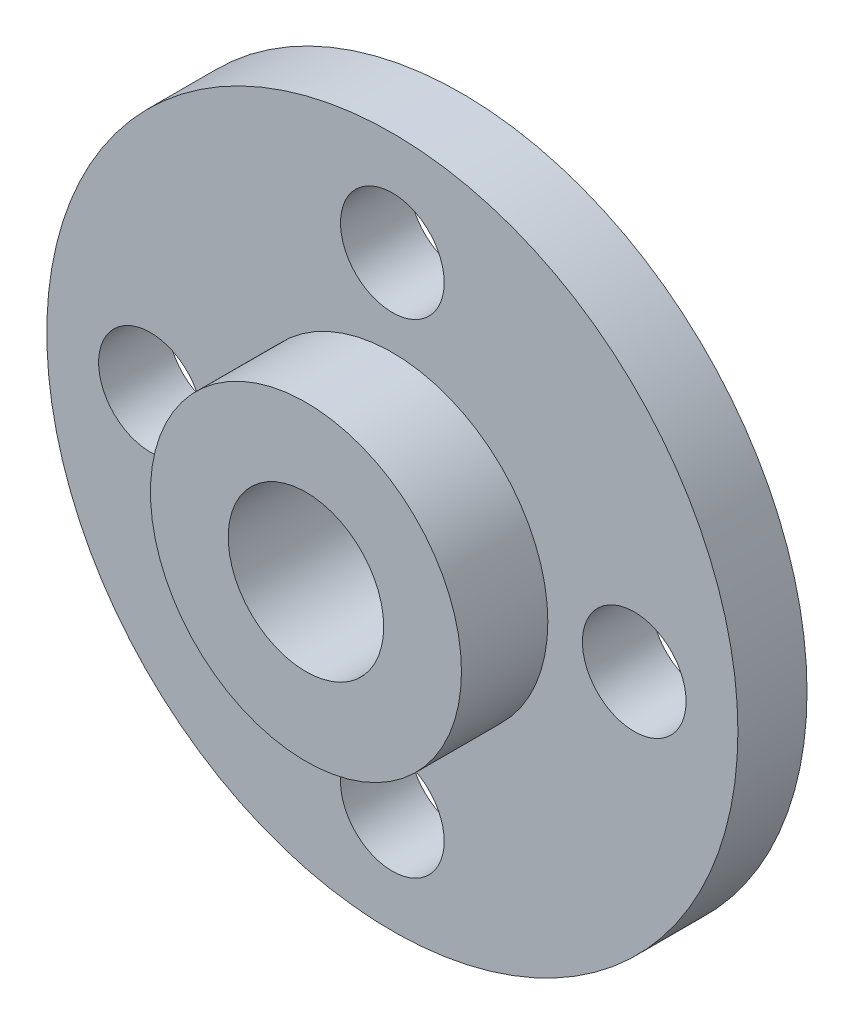
ISO-10303-21;
HEADER;
FILE_DESCRIPTION(('STEP AP214'),'2;1');
FILE_NAME('part.step','',(''),(''),'','','');
FILE_SCHEMA(('AUTOMOTIVE_DESIGN { 1 0 10303 214 1 1 1 1 }'));
ENDSEC;
DATA;
#1=APPLICATION_CONTEXT('core data for automotive mechanical design processes');
#2=APPLICATION_PROTOCOL_DEFINITION('international standard','automotive_design',2000,#1);
#3=PRODUCT_CONTEXT('',#1,'mechanical');
#4=PRODUCT('Part','Part','',(#3));
#5=PRODUCT_RELATED_PRODUCT_CATEGORY('part','',(#4));
#6=PRODUCT_DEFINITION_FORMATION('','',#4);
#7=PRODUCT_DEFINITION_CONTEXT('part definition',#1,'design');
#8=PRODUCT_DEFINITION('design','',#6,#7);
#9=PRODUCT_DEFINITION_SHAPE('','',#8);
#10=(LENGTH_UNIT() NAMED_UNIT(*) SI_UNIT(.MILLI.,.METRE.));
#11=(NAMED_UNIT(*) PLANE_ANGLE_UNIT() SI_UNIT($,.RADIAN.));
#12=(NAMED_UNIT(*) SI_UNIT($,.STERADIAN.) SOLID_ANGLE_UNIT());
#13=UNCERTAINTY_MEASURE_WITH_UNIT(LENGTH_MEASURE(1.E-05),#10,'distance_accuracy_value','');
#14=(GEOMETRIC_REPRESENTATION_CONTEXT(3) GLOBAL_UNCERTAINTY_ASSIGNED_CONTEXT((#13)) GLOBAL_UNIT_ASSIGNED_CONTEXT((#10,
#11,#12)) REPRESENTATION_CONTEXT('',''));
#15=CARTESIAN_POINT('',(0.,0.,0.));
#16=DIRECTION('',(0.,0.,1.));
#17=DIRECTION('',(1.,0.,0.));
#18=AXIS2_PLACEMENT_3D('',#15,#16,#17);
#19=CARTESIAN_POINT('',(0.,0.,2.));
#20=DIRECTION('',(0.,0.,1.));
#21=DIRECTION('',(1.,0.,0.));
#22=AXIS2_PLACEMENT_3D('',#19,#20,#21);
#23=PLANE('',#22);
#24=CARTESIAN_POINT('',(0.,7.,2.));
#25=DIRECTION('',(0.,0.,1.));
#26=DIRECTION('',(1.,0.,0.));
#27=AXIS2_PLACEMENT_3D('',#24,#25,#26);
#28=CIRCLE('',#27,1.5);
#29=CARTESIAN_POINT('',(1.50000000000007,7.,2.));
#30=VERTEX_POINT('',#29);
#31=EDGE_CURVE('E63',#30,#30,#28,.T.);
#32=ORIENTED_EDGE('',*,*,#31,.F.);
#33=EDGE_LOOP('',(#32));
#34=FACE_BOUND('',#33,.T.);
#35=CARTESIAN_POINT('',(0.,-7.,2.));
#36=DIRECTION('',(0.,0.,1.));
#37=DIRECTION('',(1.,0.,0.));
#38=AXIS2_PLACEMENT_3D('',#35,#36,#37);
#39=CIRCLE('',#38,1.5);
#40=CARTESIAN_POINT('',(1.49999999999998,-7.,2.));
#41=VERTEX_POINT('',#40);
#42=EDGE_CURVE('E51',#41,#41,#39,.T.);
#43=ORIENTED_EDGE('',*,*,#42,.F.);
#44=EDGE_LOOP('',(#43));
#45=FACE_BOUND('',#44,.T.);
#46=CARTESIAN_POINT('',(0.,0.,2.));
#47=DIRECTION('',(0.,0.,1.));
#48=DIRECTION('',(1.,0.,0.));
#49=AXIS2_PLACEMENT_3D('',#46,#47,#48);
#50=CIRCLE('',#49,10.);
#51=CARTESIAN_POINT('',(10.,0.,2.));
#52=VERTEX_POINT('',#51);
#53=EDGE_CURVE('E10',#52,#52,#50,.T.);
#54=ORIENTED_EDGE('',*,*,#53,.T.);
#55=EDGE_LOOP('',(#54));
#56=FACE_BOUND('',#55,.T.);
#57=CARTESIAN_POINT('',(7.,0.,2.));
#58=DIRECTION('',(0.,0.,1.));
#59=DIRECTION('',(1.,0.,0.));
#60=AXIS2_PLACEMENT_3D('',#57,#58,#59);
#61=CIRCLE('',#60,1.5);
#62=CARTESIAN_POINT('',(8.5,0.,2.));
#63=VERTEX_POINT('',#62);
#64=EDGE_CURVE('E47',#63,#63,#61,.T.);
#65=ORIENTED_EDGE('',*,*,#64,.F.);
#66=EDGE_LOOP('',(#65));
#67=FACE_BOUND('',#66,.T.);
#68=CARTESIAN_POINT('',(-7.,0.,2.));
#69=DIRECTION('',(0.,0.,1.));
#70=DIRECTION('',(1.,0.,0.));
#71=AXIS2_PLACEMENT_3D('',#68,#69,#70);
#72=CIRCLE('',#71,1.5);
#73=CARTESIAN_POINT('',(-5.5,0.,2.));
#74=VERTEX_POINT('',#73);
#75=EDGE_CURVE('E57',#74,#74,#72,.T.);
#76=ORIENTED_EDGE('',*,*,#75,.F.);
#77=EDGE_LOOP('',(#76));
#78=FACE_BOUND('',#77,.T.);
#79=CARTESIAN_POINT('',(0.,0.,2.));
#80=DIRECTION('',(0.,0.,1.));
#81=DIRECTION('',(1.,0.,0.));
#82=AXIS2_PLACEMENT_3D('',#79,#80,#81);
#83=CIRCLE('',#82,4.5);
#84=CARTESIAN_POINT('',(4.5,0.,2.));
#85=VERTEX_POINT('',#84);
#86=EDGE_CURVE('E72',#85,#85,#83,.T.);
#87=ORIENTED_EDGE('',*,*,#86,.F.);
#88=EDGE_LOOP('',(#87));
#89=FACE_BOUND('',#88,.T.);
#90=ADVANCED_FACE('F32',(#34,#45,#56,#67,#78,#89),#23,.T.);
#91=CARTESIAN_POINT('',(0.,0.,0.));
#92=DIRECTION('',(0.,0.,1.));
#93=DIRECTION('',(1.,0.,0.));
#94=AXIS2_PLACEMENT_3D('',#91,#92,#93);
#95=PLANE('',#94);
#96=CARTESIAN_POINT('',(0.,0.,0.));
#97=DIRECTION('',(0.,0.,1.));
#98=DIRECTION('',(1.,0.,0.));
#99=AXIS2_PLACEMENT_3D('',#96,#97,#98);
#100=CIRCLE('',#99,10.);
#101=CARTESIAN_POINT('',(10.,0.,0.));
#102=VERTEX_POINT('',#101);
#103=EDGE_CURVE('E36',#102,#102,#100,.T.);
#104=ORIENTED_EDGE('',*,*,#103,.F.);
#105=EDGE_LOOP('',(#104));
#106=FACE_BOUND('',#105,.T.);
#107=CARTESIAN_POINT('',(0.,0.,0.));
#108=DIRECTION('',(0.,0.,1.));
#109=DIRECTION('',(1.,0.,0.));
#110=AXIS2_PLACEMENT_3D('',#107,#108,#109);
#111=CIRCLE('',#110,2.25);
#112=CARTESIAN_POINT('',(2.25,0.,0.));
#113=VERTEX_POINT('',#112);
#114=EDGE_CURVE('E43',#113,#113,#111,.T.);
#115=ORIENTED_EDGE('',*,*,#114,.T.);
#116=EDGE_LOOP('',(#115));
#117=FACE_BOUND('',#116,.T.);
#118=CARTESIAN_POINT('',(7.,0.,0.));
#119=DIRECTION('',(0.,0.,1.));
#120=DIRECTION('',(1.,0.,0.));
#121=AXIS2_PLACEMENT_3D('',#118,#119,#120);
#122=CIRCLE('',#121,1.5);
#123=CARTESIAN_POINT('',(8.5,0.,0.));
#124=VERTEX_POINT('',#123);
#125=EDGE_CURVE('E48',#124,#124,#122,.T.);
#126=ORIENTED_EDGE('',*,*,#125,.T.);
#127=EDGE_LOOP('',(#126));
#128=FACE_BOUND('',#127,.T.);
#129=CARTESIAN_POINT('',(0.,-7.,0.));
#130=DIRECTION('',(0.,0.,1.));
#131=DIRECTION('',(1.,0.,0.));
#132=AXIS2_PLACEMENT_3D('',#129,#130,#131);
#133=CIRCLE('',#132,1.5);
#134=CARTESIAN_POINT('',(1.49999999999998,-7.,0.));
#135=VERTEX_POINT('',#134);
#136=EDGE_CURVE('E54',#135,#135,#133,.T.);
#137=ORIENTED_EDGE('',*,*,#136,.T.);
#138=EDGE_LOOP('',(#137));
#139=FACE_BOUND('',#138,.T.);
#140=CARTESIAN_POINT('',(-7.,0.,0.));
#141=DIRECTION('',(0.,0.,1.));
#142=DIRECTION('',(1.,0.,0.));
#143=AXIS2_PLACEMENT_3D('',#140,#141,#142);
#144=CIRCLE('',#143,1.5);
#145=CARTESIAN_POINT('',(-5.5,0.,0.));
#146=VERTEX_POINT('',#145);
#147=EDGE_CURVE('E60',#146,#146,#144,.T.);
#148=ORIENTED_EDGE('',*,*,#147,.T.);
#149=EDGE_LOOP('',(#148));
#150=FACE_BOUND('',#149,.T.);
#151=CARTESIAN_POINT('',(0.,7.,0.));
#152=DIRECTION('',(0.,0.,1.));
#153=DIRECTION('',(1.,0.,0.));
#154=AXIS2_PLACEMENT_3D('',#151,#152,#153);
#155=CIRCLE('',#154,1.5);
#156=CARTESIAN_POINT('',(1.50000000000007,7.,0.));
#157=VERTEX_POINT('',#156);
#158=EDGE_CURVE('E66',#157,#157,#155,.T.);
#159=ORIENTED_EDGE('',*,*,#158,.T.);
#160=EDGE_LOOP('',(#159));
#161=FACE_BOUND('',#160,.T.);
#162=ADVANCED_FACE('F99',(#106,#117,#128,#139,#150,#161),#95,.F.);
#163=CARTESIAN_POINT('',(0.,0.,2.));
#164=DIRECTION('',(0.,0.,-1.));
#165=DIRECTION('',(-1.,0.,0.));
#166=AXIS2_PLACEMENT_3D('',#163,#164,#165);
#167=CYLINDRICAL_SURFACE('',#166,10.);
#168=ORIENTED_EDGE('',*,*,#53,.F.);
#169=EDGE_LOOP('',(#168));
#170=FACE_BOUND('',#169,.T.);
#171=ORIENTED_EDGE('',*,*,#103,.T.);
#172=EDGE_LOOP('',(#171));
#173=FACE_BOUND('',#172,.T.);
#174=ADVANCED_FACE('F34',(#170,#173),#167,.T.);
#175=CARTESIAN_POINT('',(0.,0.,2.));
#176=DIRECTION('',(0.,0.,-1.));
#177=DIRECTION('',(-1.,0.,0.));
#178=AXIS2_PLACEMENT_3D('',#175,#176,#177);
#179=CYLINDRICAL_SURFACE('',#178,2.25);
#180=ORIENTED_EDGE('',*,*,#114,.F.);
#181=EDGE_LOOP('',(#180));
#182=FACE_BOUND('',#181,.T.);
#183=CARTESIAN_POINT('',(0.,0.,4.5));
#184=DIRECTION('',(0.,0.,1.));
#185=DIRECTION('',(1.,0.,0.));
#186=AXIS2_PLACEMENT_3D('',#183,#184,#185);
#187=CIRCLE('',#186,2.25);
#188=CARTESIAN_POINT('',(2.25,0.,4.5));
#189=VERTEX_POINT('',#188);
#190=EDGE_CURVE('E75',#189,#189,#187,.T.);
#191=ORIENTED_EDGE('',*,*,#190,.T.);
#192=EDGE_LOOP('',(#191));
#193=FACE_BOUND('',#192,.T.);
#194=ADVANCED_FACE('F81',(#182,#193),#179,.F.);
#195=CARTESIAN_POINT('',(7.,0.,2.));
#196=DIRECTION('',(0.,0.,-1.));
#197=DIRECTION('',(-1.,0.,0.));
#198=AXIS2_PLACEMENT_3D('',#195,#196,#197);
#199=CYLINDRICAL_SURFACE('',#198,1.5);
#200=ORIENTED_EDGE('',*,*,#64,.T.);
#201=EDGE_LOOP('',(#200));
#202=FACE_BOUND('',#201,.T.);
#203=ORIENTED_EDGE('',*,*,#125,.F.);
#204=EDGE_LOOP('',(#203));
#205=FACE_BOUND('',#204,.T.);
#206=ADVANCED_FACE('F111',(#202,#205),#199,.F.);
#207=CARTESIAN_POINT('',(0.,-7.,2.));
#208=DIRECTION('',(0.,0.,-1.));
#209=DIRECTION('',(-1.,0.,0.));
#210=AXIS2_PLACEMENT_3D('',#207,#208,#209);
#211=CYLINDRICAL_SURFACE('',#210,1.5);
#212=ORIENTED_EDGE('',*,*,#42,.T.);
#213=EDGE_LOOP('',(#212));
#214=FACE_BOUND('',#213,.T.);
#215=ORIENTED_EDGE('',*,*,#136,.F.);
#216=EDGE_LOOP('',(#215));
#217=FACE_BOUND('',#216,.T.);
#218=ADVANCED_FACE('F115',(#214,#217),#211,.F.);
#219=CARTESIAN_POINT('',(-7.,0.,2.));
#220=DIRECTION('',(0.,0.,-1.));
#221=DIRECTION('',(-1.,0.,0.));
#222=AXIS2_PLACEMENT_3D('',#219,#220,#221);
#223=CYLINDRICAL_SURFACE('',#222,1.5);
#224=ORIENTED_EDGE('',*,*,#75,.T.);
#225=EDGE_LOOP('',(#224));
#226=FACE_BOUND('',#225,.T.);
#227=ORIENTED_EDGE('',*,*,#147,.F.);
#228=EDGE_LOOP('',(#227));
#229=FACE_BOUND('',#228,.T.);
#230=ADVANCED_FACE('F95',(#226,#229),#223,.F.);
#231=CARTESIAN_POINT('',(0.,7.,2.));
#232=DIRECTION('',(0.,0.,-1.));
#233=DIRECTION('',(-1.,0.,0.));
#234=AXIS2_PLACEMENT_3D('',#231,#232,#233);
#235=CYLINDRICAL_SURFACE('',#234,1.5);
#236=ORIENTED_EDGE('',*,*,#31,.T.);
#237=EDGE_LOOP('',(#236));
#238=FACE_BOUND('',#237,.T.);
#239=ORIENTED_EDGE('',*,*,#158,.F.);
#240=EDGE_LOOP('',(#239));
#241=FACE_BOUND('',#240,.T.);
#242=ADVANCED_FACE('F86',(#238,#241),#235,.F.);
#243=CARTESIAN_POINT('',(0.,0.,4.5));
#244=DIRECTION('',(0.,0.,1.));
#245=DIRECTION('',(1.,0.,0.));
#246=AXIS2_PLACEMENT_3D('',#243,#244,#245);
#247=PLANE('',#246);
#248=CARTESIAN_POINT('',(0.,0.,4.5));
#249=DIRECTION('',(0.,0.,1.));
#250=DIRECTION('',(1.,0.,0.));
#251=AXIS2_PLACEMENT_3D('',#248,#249,#250);
#252=CIRCLE('',#251,4.5);
#253=CARTESIAN_POINT('',(4.5,0.,4.5));
#254=VERTEX_POINT('',#253);
#255=EDGE_CURVE('E69',#254,#254,#252,.T.);
#256=ORIENTED_EDGE('',*,*,#255,.T.);
#257=EDGE_LOOP('',(#256));
#258=FACE_BOUND('',#257,.T.);
#259=ORIENTED_EDGE('',*,*,#190,.F.);
#260=EDGE_LOOP('',(#259));
#261=FACE_BOUND('',#260,.T.);
#262=ADVANCED_FACE('F83',(#258,#261),#247,.T.);
#263=CARTESIAN_POINT('',(0.,0.,4.5));
#264=DIRECTION('',(0.,0.,-1.));
#265=DIRECTION('',(-1.,0.,0.));
#266=AXIS2_PLACEMENT_3D('',#263,#264,#265);
#267=CYLINDRICAL_SURFACE('',#266,4.5);
#268=ORIENTED_EDGE('',*,*,#255,.F.);
#269=EDGE_LOOP('',(#268));
#270=FACE_BOUND('',#269,.T.);
#271=ORIENTED_EDGE('',*,*,#86,.T.);
#272=EDGE_LOOP('',(#271));
#273=FACE_BOUND('',#272,.T.);
#274=ADVANCED_FACE('F85',(#270,#273),#267,.T.);
#275=CLOSED_SHELL('',(#90,#162,#174,#194,#206,#218,#230,#242,#262,#274));
#276=MANIFOLD_SOLID_BREP('B2',#275);
#277=ADVANCED_BREP_SHAPE_REPRESENTATION('',(#18,#276),#14);
#278=SHAPE_DEFINITION_REPRESENTATION(#9,#277);
ENDSEC;
END-ISO-10303-21;
